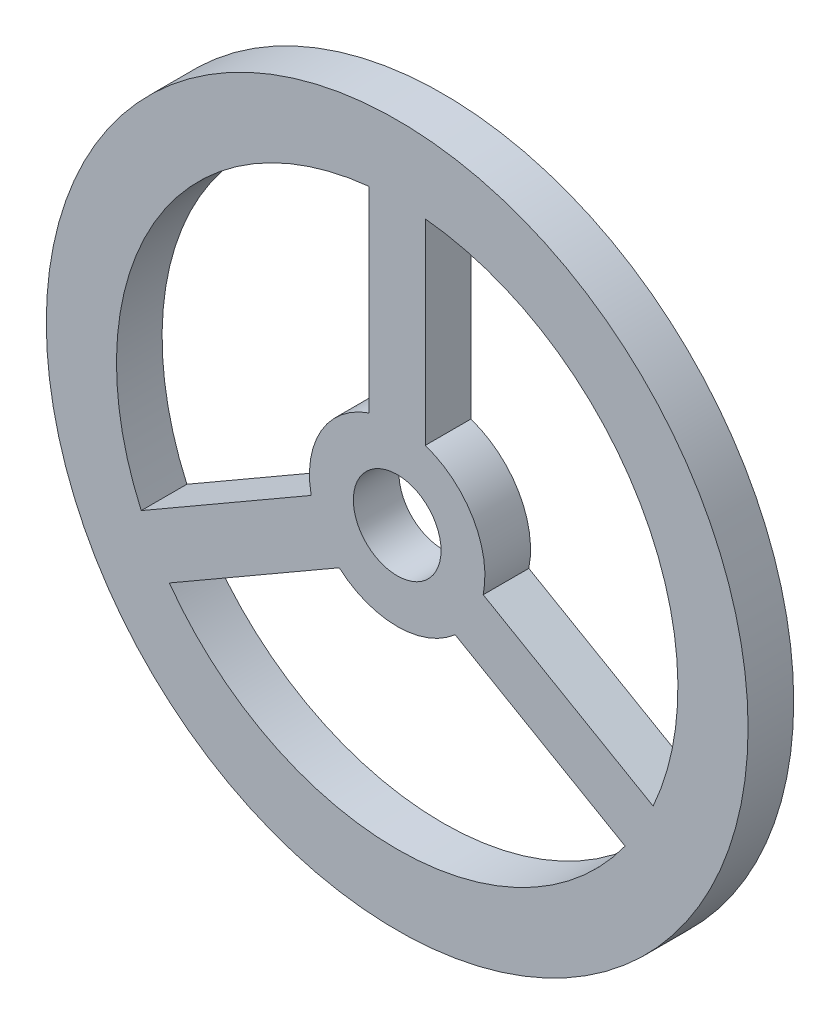
ISO-10303-21;
HEADER;
FILE_DESCRIPTION(('STEP AP214'),'2;1');
FILE_NAME('part.step','',(''),(''),'','','');
FILE_SCHEMA(('AUTOMOTIVE_DESIGN { 1 0 10303 214 1 1 1 1 }'));
ENDSEC;
DATA;
#1=APPLICATION_CONTEXT('core data for automotive mechanical design processes');
#2=APPLICATION_PROTOCOL_DEFINITION('international standard','automotive_design',2000,#1);
#3=PRODUCT_CONTEXT('',#1,'mechanical');
#4=PRODUCT('Part','Part','',(#3));
#5=PRODUCT_RELATED_PRODUCT_CATEGORY('part','',(#4));
#6=PRODUCT_DEFINITION_FORMATION('','',#4);
#7=PRODUCT_DEFINITION_CONTEXT('part definition',#1,'design');
#8=PRODUCT_DEFINITION('design','',#6,#7);
#9=PRODUCT_DEFINITION_SHAPE('','',#8);
#10=(LENGTH_UNIT() NAMED_UNIT(*) SI_UNIT(.MILLI.,.METRE.));
#11=(NAMED_UNIT(*) PLANE_ANGLE_UNIT() SI_UNIT($,.RADIAN.));
#12=(NAMED_UNIT(*) SI_UNIT($,.STERADIAN.) SOLID_ANGLE_UNIT());
#13=UNCERTAINTY_MEASURE_WITH_UNIT(LENGTH_MEASURE(1.E-05),#10,'distance_accuracy_value','');
#14=(GEOMETRIC_REPRESENTATION_CONTEXT(3) GLOBAL_UNCERTAINTY_ASSIGNED_CONTEXT((#13)) GLOBAL_UNIT_ASSIGNED_CONTEXT((#10,
#11,#12)) REPRESENTATION_CONTEXT('',''));
#15=CARTESIAN_POINT('',(0.,0.,0.));
#16=DIRECTION('',(0.,0.,1.));
#17=DIRECTION('',(1.,0.,0.));
#18=AXIS2_PLACEMENT_3D('',#15,#16,#17);
#19=CARTESIAN_POINT('',(0.,0.,1.3));
#20=DIRECTION('',(0.,0.,-1.));
#21=DIRECTION('',(-1.,0.,0.));
#22=AXIS2_PLACEMENT_3D('',#19,#20,#21);
#23=CYLINDRICAL_SURFACE('',#22,10.);
#24=CARTESIAN_POINT('',(0.,0.,1.3));
#25=DIRECTION('',(0.,0.,1.));
#26=DIRECTION('',(1.,0.,0.));
#27=AXIS2_PLACEMENT_3D('',#24,#25,#26);
#28=CIRCLE('',#27,10.);
#29=CARTESIAN_POINT('',(10.,0.,1.3));
#30=VERTEX_POINT('',#29);
#31=EDGE_CURVE('E11',#30,#30,#28,.T.);
#32=ORIENTED_EDGE('',*,*,#31,.F.);
#33=EDGE_LOOP('',(#32));
#34=FACE_BOUND('',#33,.T.);
#35=CARTESIAN_POINT('',(0.,0.,0.));
#36=DIRECTION('',(0.,0.,1.));
#37=DIRECTION('',(1.,0.,0.));
#38=AXIS2_PLACEMENT_3D('',#35,#36,#37);
#39=CIRCLE('',#38,10.);
#40=CARTESIAN_POINT('',(10.,0.,0.));
#41=VERTEX_POINT('',#40);
#42=EDGE_CURVE('E41',#41,#41,#39,.T.);
#43=ORIENTED_EDGE('',*,*,#42,.T.);
#44=EDGE_LOOP('',(#43));
#45=FACE_BOUND('',#44,.T.);
#46=ADVANCED_FACE('F38',(#34,#45),#23,.T.);
#47=CARTESIAN_POINT('',(0.,0.,1.3));
#48=DIRECTION('',(0.,0.,1.));
#49=DIRECTION('',(1.,0.,0.));
#50=AXIS2_PLACEMENT_3D('',#47,#48,#49);
#51=PLANE('',#50);
#52=CARTESIAN_POINT('',(0.,0.,1.3));
#53=DIRECTION('',(0.,0.,1.));
#54=DIRECTION('',(1.,0.,0.));
#55=AXIS2_PLACEMENT_3D('',#52,#53,#54);
#56=CIRCLE('',#55,1.25);
#57=CARTESIAN_POINT('',(1.25,0.,1.3));
#58=VERTEX_POINT('',#57);
#59=EDGE_CURVE('E158',#58,#58,#56,.T.);
#60=ORIENTED_EDGE('',*,*,#59,.F.);
#61=EDGE_LOOP('',(#60));
#62=FACE_BOUND('',#61,.T.);
#63=CARTESIAN_POINT('',(0.,0.,1.3));
#64=DIRECTION('',(0.,0.,1.));
#65=DIRECTION('',(1.,0.,0.));
#66=AXIS2_PLACEMENT_3D('',#63,#64,#65);
#67=CIRCLE('',#66,8.00000000000017);
#68=CARTESIAN_POINT('',(-6.49347517584576,-4.67277007145415,1.3));
#69=VERTEX_POINT('',#68);
#70=CARTESIAN_POINT('',(6.49347517584583,-4.67277007145405,1.3));
#71=VERTEX_POINT('',#70);
#72=EDGE_CURVE('E53',#69,#71,#67,.T.);
#73=ORIENTED_EDGE('',*,*,#72,.F.);
#74=DIRECTION('',(-0.866025403784436,-0.500000000000005,0.));
#75=VECTOR('',#74,1.);
#76=CARTESIAN_POINT('',(-6.49347517584576,-4.67277007145415,1.3));
#77=LINE('',#76,#75);
#78=CARTESIAN_POINT('',(-1.65121914967675,-1.87709225126035,1.3));
#79=VERTEX_POINT('',#78);
#80=EDGE_CURVE('E187',#79,#69,#77,.T.);
#81=ORIENTED_EDGE('',*,*,#80,.F.);
#82=CARTESIAN_POINT('',(0.,0.,1.3));
#83=DIRECTION('',(0.,0.,-1.));
#84=DIRECTION('',(1.,0.,0.));
#85=AXIS2_PLACEMENT_3D('',#82,#83,#84);
#86=CIRCLE('',#85,2.50000000000017);
#87=CARTESIAN_POINT('',(1.65121914967677,-1.87709225126033,1.3));
#88=VERTEX_POINT('',#87);
#89=EDGE_CURVE('E206',#88,#79,#86,.T.);
#90=ORIENTED_EDGE('',*,*,#89,.F.);
#91=DIRECTION('',(-0.866025403784444,0.499999999999991,0.));
#92=VECTOR('',#91,1.);
#93=CARTESIAN_POINT('',(6.49347517584583,-4.67277007145405,1.3));
#94=LINE('',#93,#92);
#95=EDGE_CURVE('E202',#71,#88,#94,.T.);
#96=ORIENTED_EDGE('',*,*,#95,.F.);
#97=EDGE_LOOP('',(#73,#81,#90,#96));
#98=FACE_BOUND('',#97,.T.);
#99=CARTESIAN_POINT('',(0.,0.,1.3));
#100=DIRECTION('',(0.,0.,-1.));
#101=DIRECTION('',(1.,0.,0.));
#102=AXIS2_PLACEMENT_3D('',#99,#100,#101);
#103=CIRCLE('',#102,2.50000000000016);
#104=CARTESIAN_POINT('',(0.800000000000001,2.36854385646557,1.3));
#105=VERTEX_POINT('',#104);
#106=CARTESIAN_POINT('',(2.45121914967676,-0.491451605205218,1.3));
#107=VERTEX_POINT('',#106);
#108=EDGE_CURVE('E61',#105,#107,#103,.T.);
#109=ORIENTED_EDGE('',*,*,#108,.F.);
#110=DIRECTION('',(0.,-1.,0.));
#111=VECTOR('',#110,1.);
#112=CARTESIAN_POINT('',(0.800000000000001,2.36854385646557,1.3));
#113=LINE('',#112,#111);
#114=CARTESIAN_POINT('',(0.800000000000003,7.95989949685313,1.3));
#115=VERTEX_POINT('',#114);
#116=EDGE_CURVE('E151',#115,#105,#113,.T.);
#117=ORIENTED_EDGE('',*,*,#116,.F.);
#118=CARTESIAN_POINT('',(0.,0.,1.3));
#119=DIRECTION('',(0.,0.,1.));
#120=DIRECTION('',(1.,0.,0.));
#121=AXIS2_PLACEMENT_3D('',#118,#119,#120);
#122=CIRCLE('',#121,8.00000000000017);
#123=CARTESIAN_POINT('',(7.29347517584582,-3.28712942539895,1.3));
#124=VERTEX_POINT('',#123);
#125=EDGE_CURVE('E155',#124,#115,#122,.T.);
#126=ORIENTED_EDGE('',*,*,#125,.F.);
#127=DIRECTION('',(0.866025403784444,-0.499999999999991,0.));
#128=VECTOR('',#127,1.);
#129=CARTESIAN_POINT('',(2.45121914967676,-0.491451605205218,1.3));
#130=LINE('',#129,#128);
#131=EDGE_CURVE('E167',#107,#124,#130,.T.);
#132=ORIENTED_EDGE('',*,*,#131,.F.);
#133=EDGE_LOOP('',(#109,#117,#126,#132));
#134=FACE_BOUND('',#133,.T.);
#135=CARTESIAN_POINT('',(0.,0.,1.3));
#136=DIRECTION('',(0.,0.,1.));
#137=DIRECTION('',(1.,0.,0.));
#138=AXIS2_PLACEMENT_3D('',#135,#136,#137);
#139=CIRCLE('',#138,8.00000000000017);
#140=CARTESIAN_POINT('',(-0.8,7.95989949685312,1.3));
#141=VERTEX_POINT('',#140);
#142=CARTESIAN_POINT('',(-7.29347517584577,-3.28712942539905,1.3));
#143=VERTEX_POINT('',#142);
#144=EDGE_CURVE('E216',#141,#143,#139,.T.);
#145=ORIENTED_EDGE('',*,*,#144,.F.);
#146=DIRECTION('',(0.,1.,0.));
#147=VECTOR('',#146,1.);
#148=CARTESIAN_POINT('',(-0.8,7.95989949685312,1.3));
#149=LINE('',#148,#147);
#150=CARTESIAN_POINT('',(-0.800000000000001,2.36854385646558,1.3));
#151=VERTEX_POINT('',#150);
#152=EDGE_CURVE('E230',#151,#141,#149,.T.);
#153=ORIENTED_EDGE('',*,*,#152,.F.);
#154=CARTESIAN_POINT('',(0.,0.,1.3));
#155=DIRECTION('',(0.,0.,-1.));
#156=DIRECTION('',(1.,0.,0.));
#157=AXIS2_PLACEMENT_3D('',#154,#155,#156);
#158=CIRCLE('',#157,2.50000000000016);
#159=CARTESIAN_POINT('',(-2.45121914967676,-0.491451605205248,1.3));
#160=VERTEX_POINT('',#159);
#161=EDGE_CURVE('E249',#160,#151,#158,.T.);
#162=ORIENTED_EDGE('',*,*,#161,.F.);
#163=DIRECTION('',(0.866025403784436,0.500000000000004,0.));
#164=VECTOR('',#163,1.);
#165=CARTESIAN_POINT('',(-7.29347517584577,-3.28712942539905,1.3));
#166=LINE('',#165,#164);
#167=EDGE_CURVE('E245',#143,#160,#166,.T.);
#168=ORIENTED_EDGE('',*,*,#167,.F.);
#169=EDGE_LOOP('',(#145,#153,#162,#168));
#170=FACE_BOUND('',#169,.T.);
#171=ORIENTED_EDGE('',*,*,#31,.T.);
#172=EDGE_LOOP('',(#171));
#173=FACE_BOUND('',#172,.T.);
#174=ADVANCED_FACE('F277',(#62,#98,#134,#170,#173),#51,.T.);
#175=CARTESIAN_POINT('',(0.,0.,0.));
#176=DIRECTION('',(0.,0.,1.));
#177=DIRECTION('',(1.,0.,0.));
#178=AXIS2_PLACEMENT_3D('',#175,#176,#177);
#179=PLANE('',#178);
#180=CARTESIAN_POINT('',(0.,0.,0.));
#181=DIRECTION('',(0.,0.,1.));
#182=DIRECTION('',(1.,0.,0.));
#183=AXIS2_PLACEMENT_3D('',#180,#181,#182);
#184=CIRCLE('',#183,1.25);
#185=CARTESIAN_POINT('',(1.25,0.,0.));
#186=VERTEX_POINT('',#185);
#187=EDGE_CURVE('E168',#186,#186,#184,.T.);
#188=ORIENTED_EDGE('',*,*,#187,.T.);
#189=EDGE_LOOP('',(#188));
#190=FACE_BOUND('',#189,.T.);
#191=DIRECTION('',(-0.866025403784436,-0.500000000000005,0.));
#192=VECTOR('',#191,1.);
#193=CARTESIAN_POINT('',(-6.49347517584576,-4.67277007145415,0.));
#194=LINE('',#193,#192);
#195=CARTESIAN_POINT('',(-1.65121914967675,-1.87709225126035,0.));
#196=VERTEX_POINT('',#195);
#197=CARTESIAN_POINT('',(-6.49347517584576,-4.67277007145415,0.));
#198=VERTEX_POINT('',#197);
#199=EDGE_CURVE('E195',#196,#198,#194,.T.);
#200=ORIENTED_EDGE('',*,*,#199,.T.);
#201=CARTESIAN_POINT('',(0.,0.,0.));
#202=DIRECTION('',(0.,0.,1.));
#203=DIRECTION('',(1.,0.,0.));
#204=AXIS2_PLACEMENT_3D('',#201,#202,#203);
#205=CIRCLE('',#204,8.00000000000017);
#206=CARTESIAN_POINT('',(6.49347517584583,-4.67277007145405,0.));
#207=VERTEX_POINT('',#206);
#208=EDGE_CURVE('E182',#198,#207,#205,.T.);
#209=ORIENTED_EDGE('',*,*,#208,.T.);
#210=DIRECTION('',(-0.866025403784444,0.499999999999991,0.));
#211=VECTOR('',#210,1.);
#212=CARTESIAN_POINT('',(6.49347517584583,-4.67277007145405,0.));
#213=LINE('',#212,#211);
#214=CARTESIAN_POINT('',(1.65121914967677,-1.87709225126033,0.));
#215=VERTEX_POINT('',#214);
#216=EDGE_CURVE('E186',#207,#215,#213,.T.);
#217=ORIENTED_EDGE('',*,*,#216,.T.);
#218=CARTESIAN_POINT('',(0.,0.,0.));
#219=DIRECTION('',(0.,0.,-1.));
#220=DIRECTION('',(1.,0.,0.));
#221=AXIS2_PLACEMENT_3D('',#218,#219,#220);
#222=CIRCLE('',#221,2.50000000000017);
#223=EDGE_CURVE('E191',#215,#196,#222,.T.);
#224=ORIENTED_EDGE('',*,*,#223,.T.);
#225=EDGE_LOOP('',(#200,#209,#217,#224));
#226=FACE_BOUND('',#225,.T.);
#227=DIRECTION('',(0.,-1.,0.));
#228=VECTOR('',#227,1.);
#229=CARTESIAN_POINT('',(0.800000000000001,2.36854385646557,0.));
#230=LINE('',#229,#228);
#231=CARTESIAN_POINT('',(0.800000000000003,7.95989949685313,0.));
#232=VERTEX_POINT('',#231);
#233=CARTESIAN_POINT('',(0.800000000000001,2.36854385646557,0.));
#234=VERTEX_POINT('',#233);
#235=EDGE_CURVE('E136',#232,#234,#230,.T.);
#236=ORIENTED_EDGE('',*,*,#235,.T.);
#237=CARTESIAN_POINT('',(0.,0.,0.));
#238=DIRECTION('',(0.,0.,-1.));
#239=DIRECTION('',(1.,0.,0.));
#240=AXIS2_PLACEMENT_3D('',#237,#238,#239);
#241=CIRCLE('',#240,2.50000000000016);
#242=CARTESIAN_POINT('',(2.45121914967676,-0.491451605205218,0.));
#243=VERTEX_POINT('',#242);
#244=EDGE_CURVE('E129',#234,#243,#241,.T.);
#245=ORIENTED_EDGE('',*,*,#244,.T.);
#246=DIRECTION('',(0.866025403784444,-0.499999999999991,0.));
#247=VECTOR('',#246,1.);
#248=CARTESIAN_POINT('',(2.45121914967676,-0.491451605205218,0.));
#249=LINE('',#248,#247);
#250=CARTESIAN_POINT('',(7.29347517584582,-3.28712942539895,0.));
#251=VERTEX_POINT('',#250);
#252=EDGE_CURVE('E140',#243,#251,#249,.T.);
#253=ORIENTED_EDGE('',*,*,#252,.T.);
#254=CARTESIAN_POINT('',(0.,0.,0.));
#255=DIRECTION('',(0.,0.,1.));
#256=DIRECTION('',(1.,0.,0.));
#257=AXIS2_PLACEMENT_3D('',#254,#255,#256);
#258=CIRCLE('',#257,8.00000000000017);
#259=EDGE_CURVE('E145',#251,#232,#258,.T.);
#260=ORIENTED_EDGE('',*,*,#259,.T.);
#261=EDGE_LOOP('',(#236,#245,#253,#260));
#262=FACE_BOUND('',#261,.T.);
#263=DIRECTION('',(0.,1.,0.));
#264=VECTOR('',#263,1.);
#265=CARTESIAN_POINT('',(-0.8,7.95989949685312,0.));
#266=LINE('',#265,#264);
#267=CARTESIAN_POINT('',(-0.800000000000001,2.36854385646558,0.));
#268=VERTEX_POINT('',#267);
#269=CARTESIAN_POINT('',(-0.8,7.95989949685312,0.));
#270=VERTEX_POINT('',#269);
#271=EDGE_CURVE('E238',#268,#270,#266,.T.);
#272=ORIENTED_EDGE('',*,*,#271,.T.);
#273=CARTESIAN_POINT('',(0.,0.,0.));
#274=DIRECTION('',(0.,0.,1.));
#275=DIRECTION('',(1.,0.,0.));
#276=AXIS2_PLACEMENT_3D('',#273,#274,#275);
#277=CIRCLE('',#276,8.00000000000017);
#278=CARTESIAN_POINT('',(-7.29347517584577,-3.28712942539905,0.));
#279=VERTEX_POINT('',#278);
#280=EDGE_CURVE('E225',#270,#279,#277,.T.);
#281=ORIENTED_EDGE('',*,*,#280,.T.);
#282=DIRECTION('',(0.866025403784436,0.500000000000004,0.));
#283=VECTOR('',#282,1.);
#284=CARTESIAN_POINT('',(-7.29347517584577,-3.28712942539905,0.));
#285=LINE('',#284,#283);
#286=CARTESIAN_POINT('',(-2.45121914967676,-0.491451605205248,0.));
#287=VERTEX_POINT('',#286);
#288=EDGE_CURVE('E229',#279,#287,#285,.T.);
#289=ORIENTED_EDGE('',*,*,#288,.T.);
#290=CARTESIAN_POINT('',(0.,0.,0.));
#291=DIRECTION('',(0.,0.,-1.));
#292=DIRECTION('',(1.,0.,0.));
#293=AXIS2_PLACEMENT_3D('',#290,#291,#292);
#294=CIRCLE('',#293,2.50000000000016);
#295=EDGE_CURVE('E234',#287,#268,#294,.T.);
#296=ORIENTED_EDGE('',*,*,#295,.T.);
#297=EDGE_LOOP('',(#272,#281,#289,#296));
#298=FACE_BOUND('',#297,.T.);
#299=ORIENTED_EDGE('',*,*,#42,.F.);
#300=EDGE_LOOP('',(#299));
#301=FACE_BOUND('',#300,.T.);
#302=ADVANCED_FACE('F147',(#190,#226,#262,#298,#301),#179,.F.);
#303=CARTESIAN_POINT('',(0.,0.,0.));
#304=DIRECTION('',(0.,0.,1.));
#305=DIRECTION('',(1.,0.,0.));
#306=AXIS2_PLACEMENT_3D('',#303,#304,#305);
#307=CYLINDRICAL_SURFACE('',#306,8.00000000000017);
#308=ORIENTED_EDGE('',*,*,#144,.T.);
#309=DIRECTION('',(0.,0.,1.));
#310=VECTOR('',#309,1.);
#311=CARTESIAN_POINT('',(-7.29347517584577,-3.28712942539905,0.));
#312=LINE('',#311,#310);
#313=EDGE_CURVE('E242',#279,#143,#312,.T.);
#314=ORIENTED_EDGE('',*,*,#313,.F.);
#315=ORIENTED_EDGE('',*,*,#280,.F.);
#316=DIRECTION('',(0.,0.,1.));
#317=VECTOR('',#316,1.);
#318=CARTESIAN_POINT('',(-0.8,7.95989949685312,0.));
#319=LINE('',#318,#317);
#320=EDGE_CURVE('E256',#270,#141,#319,.T.);
#321=ORIENTED_EDGE('',*,*,#320,.T.);
#322=EDGE_LOOP('',(#308,#314,#315,#321));
#323=FACE_BOUND('',#322,.T.);
#324=ADVANCED_FACE('F284',(#323),#307,.F.);
#325=CARTESIAN_POINT('',(-0.8,7.95989949685312,0.));
#326=DIRECTION('',(1.,0.,0.));
#327=DIRECTION('',(0.,1.,0.));
#328=AXIS2_PLACEMENT_3D('',#325,#326,#327);
#329=PLANE('',#328);
#330=ORIENTED_EDGE('',*,*,#152,.T.);
#331=ORIENTED_EDGE('',*,*,#320,.F.);
#332=ORIENTED_EDGE('',*,*,#271,.F.);
#333=DIRECTION('',(0.,0.,1.));
#334=VECTOR('',#333,1.);
#335=CARTESIAN_POINT('',(-0.800000000000001,2.36854385646558,0.));
#336=LINE('',#335,#334);
#337=EDGE_CURVE('E259',#268,#151,#336,.T.);
#338=ORIENTED_EDGE('',*,*,#337,.T.);
#339=EDGE_LOOP('',(#330,#331,#332,#338));
#340=FACE_BOUND('',#339,.T.);
#341=ADVANCED_FACE('F286',(#340),#329,.F.);
#342=CARTESIAN_POINT('',(0.,0.,0.));
#343=DIRECTION('',(0.,0.,1.));
#344=DIRECTION('',(1.,0.,0.));
#345=AXIS2_PLACEMENT_3D('',#342,#343,#344);
#346=CYLINDRICAL_SURFACE('',#345,2.50000000000016);
#347=ORIENTED_EDGE('',*,*,#161,.T.);
#348=ORIENTED_EDGE('',*,*,#337,.F.);
#349=ORIENTED_EDGE('',*,*,#295,.F.);
#350=DIRECTION('',(0.,0.,1.));
#351=VECTOR('',#350,1.);
#352=CARTESIAN_POINT('',(-2.45121914967676,-0.491451605205248,0.));
#353=LINE('',#352,#351);
#354=EDGE_CURVE('E262',#287,#160,#353,.T.);
#355=ORIENTED_EDGE('',*,*,#354,.T.);
#356=EDGE_LOOP('',(#347,#348,#349,#355));
#357=FACE_BOUND('',#356,.T.);
#358=ADVANCED_FACE('F281',(#357),#346,.T.);
#359=CARTESIAN_POINT('',(-7.29347517584577,-3.28712942539905,0.));
#360=DIRECTION('',(0.500000000000004,-0.866025403784436,0.));
#361=DIRECTION('',(0.866025403784436,0.500000000000004,0.));
#362=AXIS2_PLACEMENT_3D('',#359,#360,#361);
#363=PLANE('',#362);
#364=ORIENTED_EDGE('',*,*,#167,.T.);
#365=ORIENTED_EDGE('',*,*,#354,.F.);
#366=ORIENTED_EDGE('',*,*,#288,.F.);
#367=ORIENTED_EDGE('',*,*,#313,.T.);
#368=EDGE_LOOP('',(#364,#365,#366,#367));
#369=FACE_BOUND('',#368,.T.);
#370=ADVANCED_FACE('F270',(#369),#363,.F.);
#371=CARTESIAN_POINT('',(0.,0.,0.));
#372=DIRECTION('',(0.,0.,1.));
#373=DIRECTION('',(1.,0.,0.));
#374=AXIS2_PLACEMENT_3D('',#371,#372,#373);
#375=CYLINDRICAL_SURFACE('',#374,2.50000000000016);
#376=ORIENTED_EDGE('',*,*,#108,.T.);
#377=DIRECTION('',(0.,0.,1.));
#378=VECTOR('',#377,1.);
#379=CARTESIAN_POINT('',(2.45121914967676,-0.491451605205218,0.));
#380=LINE('',#379,#378);
#381=EDGE_CURVE('E125',#243,#107,#380,.T.);
#382=ORIENTED_EDGE('',*,*,#381,.F.);
#383=ORIENTED_EDGE('',*,*,#244,.F.);
#384=DIRECTION('',(0.,0.,1.));
#385=VECTOR('',#384,1.);
#386=CARTESIAN_POINT('',(0.800000000000001,2.36854385646557,0.));
#387=LINE('',#386,#385);
#388=EDGE_CURVE('E174',#234,#105,#387,.T.);
#389=ORIENTED_EDGE('',*,*,#388,.T.);
#390=EDGE_LOOP('',(#376,#382,#383,#389));
#391=FACE_BOUND('',#390,.T.);
#392=ADVANCED_FACE('F127',(#391),#375,.T.);
#393=CARTESIAN_POINT('',(0.800000000000001,2.36854385646557,0.));
#394=DIRECTION('',(-1.,0.,0.));
#395=DIRECTION('',(0.,0.,1.));
#396=AXIS2_PLACEMENT_3D('',#393,#394,#395);
#397=PLANE('',#396);
#398=ORIENTED_EDGE('',*,*,#116,.T.);
#399=ORIENTED_EDGE('',*,*,#388,.F.);
#400=ORIENTED_EDGE('',*,*,#235,.F.);
#401=DIRECTION('',(0.,0.,1.));
#402=VECTOR('',#401,1.);
#403=CARTESIAN_POINT('',(0.800000000000003,7.95989949685313,0.));
#404=LINE('',#403,#402);
#405=EDGE_CURVE('E177',#232,#115,#404,.T.);
#406=ORIENTED_EDGE('',*,*,#405,.T.);
#407=EDGE_LOOP('',(#398,#399,#400,#406));
#408=FACE_BOUND('',#407,.T.);
#409=ADVANCED_FACE('F319',(#408),#397,.F.);
#410=CARTESIAN_POINT('',(0.,0.,0.));
#411=DIRECTION('',(0.,0.,1.));
#412=DIRECTION('',(1.,0.,0.));
#413=AXIS2_PLACEMENT_3D('',#410,#411,#412);
#414=CYLINDRICAL_SURFACE('',#413,8.00000000000017);
#415=ORIENTED_EDGE('',*,*,#125,.T.);
#416=ORIENTED_EDGE('',*,*,#405,.F.);
#417=ORIENTED_EDGE('',*,*,#259,.F.);
#418=DIRECTION('',(0.,0.,1.));
#419=VECTOR('',#418,1.);
#420=CARTESIAN_POINT('',(7.29347517584582,-3.28712942539895,0.));
#421=LINE('',#420,#419);
#422=EDGE_CURVE('E135',#251,#124,#421,.T.);
#423=ORIENTED_EDGE('',*,*,#422,.T.);
#424=EDGE_LOOP('',(#415,#416,#417,#423));
#425=FACE_BOUND('',#424,.T.);
#426=ADVANCED_FACE('F324',(#425),#414,.F.);
#427=CARTESIAN_POINT('',(2.45121914967676,-0.491451605205218,0.));
#428=DIRECTION('',(-0.499999999999991,-0.866025403784444,0.));
#429=DIRECTION('',(0.866025403784444,-0.499999999999991,0.));
#430=AXIS2_PLACEMENT_3D('',#427,#428,#429);
#431=PLANE('',#430);
#432=ORIENTED_EDGE('',*,*,#131,.T.);
#433=ORIENTED_EDGE('',*,*,#422,.F.);
#434=ORIENTED_EDGE('',*,*,#252,.F.);
#435=ORIENTED_EDGE('',*,*,#381,.T.);
#436=EDGE_LOOP('',(#432,#433,#434,#435));
#437=FACE_BOUND('',#436,.T.);
#438=ADVANCED_FACE('F141',(#437),#431,.F.);
#439=CARTESIAN_POINT('',(0.,0.,0.));
#440=DIRECTION('',(0.,0.,1.));
#441=DIRECTION('',(1.,0.,0.));
#442=AXIS2_PLACEMENT_3D('',#439,#440,#441);
#443=CYLINDRICAL_SURFACE('',#442,8.00000000000017);
#444=ORIENTED_EDGE('',*,*,#72,.T.);
#445=DIRECTION('',(0.,0.,1.));
#446=VECTOR('',#445,1.);
#447=CARTESIAN_POINT('',(6.49347517584583,-4.67277007145405,0.));
#448=LINE('',#447,#446);
#449=EDGE_CURVE('E199',#207,#71,#448,.T.);
#450=ORIENTED_EDGE('',*,*,#449,.F.);
#451=ORIENTED_EDGE('',*,*,#208,.F.);
#452=DIRECTION('',(0.,0.,1.));
#453=VECTOR('',#452,1.);
#454=CARTESIAN_POINT('',(-6.49347517584576,-4.67277007145415,0.));
#455=LINE('',#454,#453);
#456=EDGE_CURVE('E213',#198,#69,#455,.T.);
#457=ORIENTED_EDGE('',*,*,#456,.T.);
#458=EDGE_LOOP('',(#444,#450,#451,#457));
#459=FACE_BOUND('',#458,.T.);
#460=ADVANCED_FACE('F334',(#459),#443,.F.);
#461=CARTESIAN_POINT('',(-6.49347517584576,-4.67277007145415,0.));
#462=DIRECTION('',(-0.500000000000005,0.866025403784436,0.));
#463=DIRECTION('',(-0.866025403784436,-0.500000000000005,0.));
#464=AXIS2_PLACEMENT_3D('',#461,#462,#463);
#465=PLANE('',#464);
#466=ORIENTED_EDGE('',*,*,#80,.T.);
#467=ORIENTED_EDGE('',*,*,#456,.F.);
#468=ORIENTED_EDGE('',*,*,#199,.F.);
#469=DIRECTION('',(0.,0.,1.));
#470=VECTOR('',#469,1.);
#471=CARTESIAN_POINT('',(-1.65121914967675,-1.87709225126035,0.));
#472=LINE('',#471,#470);
#473=EDGE_CURVE('E217',#196,#79,#472,.T.);
#474=ORIENTED_EDGE('',*,*,#473,.T.);
#475=EDGE_LOOP('',(#466,#467,#468,#474));
#476=FACE_BOUND('',#475,.T.);
#477=ADVANCED_FACE('F330',(#476),#465,.F.);
#478=CARTESIAN_POINT('',(0.,0.,0.));
#479=DIRECTION('',(0.,0.,1.));
#480=DIRECTION('',(1.,0.,0.));
#481=AXIS2_PLACEMENT_3D('',#478,#479,#480);
#482=CYLINDRICAL_SURFACE('',#481,2.50000000000017);
#483=ORIENTED_EDGE('',*,*,#89,.T.);
#484=ORIENTED_EDGE('',*,*,#473,.F.);
#485=ORIENTED_EDGE('',*,*,#223,.F.);
#486=DIRECTION('',(0.,0.,1.));
#487=VECTOR('',#486,1.);
#488=CARTESIAN_POINT('',(1.65121914967677,-1.87709225126033,0.));
#489=LINE('',#488,#487);
#490=EDGE_CURVE('E220',#215,#88,#489,.T.);
#491=ORIENTED_EDGE('',*,*,#490,.T.);
#492=EDGE_LOOP('',(#483,#484,#485,#491));
#493=FACE_BOUND('',#492,.T.);
#494=ADVANCED_FACE('F333',(#493),#482,.T.);
#495=CARTESIAN_POINT('',(6.49347517584583,-4.67277007145405,0.));
#496=DIRECTION('',(0.499999999999991,0.866025403784444,0.));
#497=DIRECTION('',(-0.866025403784444,0.499999999999991,0.));
#498=AXIS2_PLACEMENT_3D('',#495,#496,#497);
#499=PLANE('',#498);
#500=ORIENTED_EDGE('',*,*,#95,.T.);
#501=ORIENTED_EDGE('',*,*,#490,.F.);
#502=ORIENTED_EDGE('',*,*,#216,.F.);
#503=ORIENTED_EDGE('',*,*,#449,.T.);
#504=EDGE_LOOP('',(#500,#501,#502,#503));
#505=FACE_BOUND('',#504,.T.);
#506=ADVANCED_FACE('F338',(#505),#499,.F.);
#507=CARTESIAN_POINT('',(0.,0.,0.));
#508=DIRECTION('',(0.,0.,1.));
#509=DIRECTION('',(1.,0.,0.));
#510=AXIS2_PLACEMENT_3D('',#507,#508,#509);
#511=CYLINDRICAL_SURFACE('',#510,1.25);
#512=ORIENTED_EDGE('',*,*,#187,.F.);
#513=EDGE_LOOP('',(#512));
#514=FACE_BOUND('',#513,.T.);
#515=ORIENTED_EDGE('',*,*,#59,.T.);
#516=EDGE_LOOP('',(#515));
#517=FACE_BOUND('',#516,.T.);
#518=ADVANCED_FACE('F341',(#514,#517),#511,.F.);
#519=CLOSED_SHELL('',(#46,#174,#302,#324,#341,#358,#370,#392,#409,#426,#438,#460,#477,#494,#506,#518));
#520=MANIFOLD_SOLID_BREP('B2',#519);
#521=ADVANCED_BREP_SHAPE_REPRESENTATION('',(#18,#520),#14);
#522=SHAPE_DEFINITION_REPRESENTATION(#9,#521);
ENDSEC;
END-ISO-10303-21;
